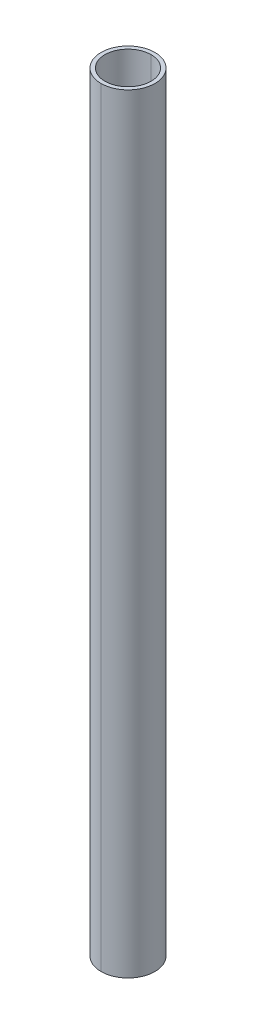
ISO-10303-21;
HEADER;
FILE_DESCRIPTION(('STEP AP214'),'2;1');
FILE_NAME('part.step','',(''),(''),'','','');
FILE_SCHEMA(('AUTOMOTIVE_DESIGN { 1 0 10303 214 1 1 1 1 }'));
ENDSEC;
DATA;
#1=APPLICATION_CONTEXT('core data for automotive mechanical design processes');
#2=APPLICATION_PROTOCOL_DEFINITION('international standard','automotive_design',2000,#1);
#3=PRODUCT_CONTEXT('',#1,'mechanical');
#4=PRODUCT('Part','Part','',(#3));
#5=PRODUCT_RELATED_PRODUCT_CATEGORY('part','',(#4));
#6=PRODUCT_DEFINITION_FORMATION('','',#4);
#7=PRODUCT_DEFINITION_CONTEXT('part definition',#1,'design');
#8=PRODUCT_DEFINITION('design','',#6,#7);
#9=PRODUCT_DEFINITION_SHAPE('','',#8);
#10=(LENGTH_UNIT() NAMED_UNIT(*) SI_UNIT(.MILLI.,.METRE.));
#11=(NAMED_UNIT(*) PLANE_ANGLE_UNIT() SI_UNIT($,.RADIAN.));
#12=(NAMED_UNIT(*) SI_UNIT($,.STERADIAN.) SOLID_ANGLE_UNIT());
#13=UNCERTAINTY_MEASURE_WITH_UNIT(LENGTH_MEASURE(1.E-05),#10,'distance_accuracy_value','');
#14=(GEOMETRIC_REPRESENTATION_CONTEXT(3) GLOBAL_UNCERTAINTY_ASSIGNED_CONTEXT((#13)) GLOBAL_UNIT_ASSIGNED_CONTEXT((#10,
#11,#12)) REPRESENTATION_CONTEXT('',''));
#15=CARTESIAN_POINT('',(0.,0.,0.));
#16=DIRECTION('',(0.,0.,1.));
#17=DIRECTION('',(1.,0.,0.));
#18=AXIS2_PLACEMENT_3D('',#15,#16,#17);
#19=CARTESIAN_POINT('',(0.,200.,0.));
#20=DIRECTION('',(0.,-1.,0.));
#21=DIRECTION('',(0.,0.,-1.));
#22=AXIS2_PLACEMENT_3D('',#19,#20,#21);
#23=CYLINDRICAL_SURFACE('',#22,6.);
#24=CARTESIAN_POINT('',(0.,200.,0.));
#25=DIRECTION('',(0.,1.,0.));
#26=DIRECTION('',(0.,0.,1.));
#27=AXIS2_PLACEMENT_3D('',#24,#25,#26);
#28=CIRCLE('',#27,6.);
#29=CARTESIAN_POINT('',(0.,200.,-6.));
#30=VERTEX_POINT('',#29);
#31=CARTESIAN_POINT('',(0.,200.,6.));
#32=VERTEX_POINT('',#31);
#33=EDGE_CURVE('E11',#30,#32,#28,.T.);
#34=ORIENTED_EDGE('',*,*,#33,.T.);
#35=DIRECTION('',(0.,-1.,0.));
#36=VECTOR('',#35,1.);
#37=CARTESIAN_POINT('',(0.,200.,6.));
#38=LINE('',#37,#36);
#39=CARTESIAN_POINT('',(0.,0.,6.));
#40=VERTEX_POINT('',#39);
#41=EDGE_CURVE('E26',#32,#40,#38,.T.);
#42=ORIENTED_EDGE('',*,*,#41,.T.);
#43=CARTESIAN_POINT('',(0.,0.,0.));
#44=DIRECTION('',(0.,1.,0.));
#45=DIRECTION('',(0.,0.,1.));
#46=AXIS2_PLACEMENT_3D('',#43,#44,#45);
#47=CIRCLE('',#46,6.);
#48=CARTESIAN_POINT('',(0.,0.,-6.));
#49=VERTEX_POINT('',#48);
#50=EDGE_CURVE('E50',#49,#40,#47,.T.);
#51=ORIENTED_EDGE('',*,*,#50,.F.);
#52=DIRECTION('',(0.,-1.,0.));
#53=VECTOR('',#52,1.);
#54=CARTESIAN_POINT('',(0.,200.,-6.));
#55=LINE('',#54,#53);
#56=EDGE_CURVE('E75',#30,#49,#55,.T.);
#57=ORIENTED_EDGE('',*,*,#56,.F.);
#58=EDGE_LOOP('',(#34,#42,#51,#57));
#59=FACE_BOUND('',#58,.T.);
#60=ADVANCED_FACE('F16',(#59),#23,.F.);
#61=CARTESIAN_POINT('',(0.,200.,0.));
#62=DIRECTION('',(0.,-1.,0.));
#63=DIRECTION('',(0.,0.,-1.));
#64=AXIS2_PLACEMENT_3D('',#61,#62,#63);
#65=CYLINDRICAL_SURFACE('',#64,7.);
#66=CARTESIAN_POINT('',(0.,200.,0.));
#67=DIRECTION('',(0.,1.,0.));
#68=DIRECTION('',(0.,0.,1.));
#69=AXIS2_PLACEMENT_3D('',#66,#67,#68);
#70=CIRCLE('',#69,7.);
#71=CARTESIAN_POINT('',(0.,200.,7.));
#72=VERTEX_POINT('',#71);
#73=CARTESIAN_POINT('',(0.,200.,-7.));
#74=VERTEX_POINT('',#73);
#75=EDGE_CURVE('E95',#72,#74,#70,.T.);
#76=ORIENTED_EDGE('',*,*,#75,.F.);
#77=DIRECTION('',(0.,-1.,0.));
#78=VECTOR('',#77,1.);
#79=CARTESIAN_POINT('',(0.,200.,7.));
#80=LINE('',#79,#78);
#81=CARTESIAN_POINT('',(0.,0.,7.));
#82=VERTEX_POINT('',#81);
#83=EDGE_CURVE('E105',#72,#82,#80,.T.);
#84=ORIENTED_EDGE('',*,*,#83,.T.);
#85=CARTESIAN_POINT('',(0.,0.,0.));
#86=DIRECTION('',(0.,1.,0.));
#87=DIRECTION('',(0.,0.,1.));
#88=AXIS2_PLACEMENT_3D('',#85,#86,#87);
#89=CIRCLE('',#88,7.);
#90=CARTESIAN_POINT('',(0.,0.,-7.));
#91=VERTEX_POINT('',#90);
#92=EDGE_CURVE('E20',#82,#91,#89,.T.);
#93=ORIENTED_EDGE('',*,*,#92,.T.);
#94=DIRECTION('',(0.,-1.,0.));
#95=VECTOR('',#94,1.);
#96=CARTESIAN_POINT('',(0.,200.,-7.));
#97=LINE('',#96,#95);
#98=EDGE_CURVE('E91',#74,#91,#97,.T.);
#99=ORIENTED_EDGE('',*,*,#98,.F.);
#100=EDGE_LOOP('',(#76,#84,#93,#99));
#101=FACE_BOUND('',#100,.T.);
#102=ADVANCED_FACE('F126',(#101),#65,.T.);
#103=CARTESIAN_POINT('',(0.,200.,0.));
#104=DIRECTION('',(0.,1.,0.));
#105=DIRECTION('',(1.,0.,0.));
#106=AXIS2_PLACEMENT_3D('',#103,#104,#105);
#107=PLANE('',#106);
#108=CARTESIAN_POINT('',(0.,200.,0.));
#109=DIRECTION('',(0.,1.,0.));
#110=DIRECTION('',(0.,0.,1.));
#111=AXIS2_PLACEMENT_3D('',#108,#109,#110);
#112=CIRCLE('',#111,7.);
#113=EDGE_CURVE('E96',#74,#72,#112,.T.);
#114=ORIENTED_EDGE('',*,*,#113,.T.);
#115=ORIENTED_EDGE('',*,*,#75,.T.);
#116=EDGE_LOOP('',(#114,#115));
#117=FACE_BOUND('',#116,.T.);
#118=ORIENTED_EDGE('',*,*,#33,.F.);
#119=CARTESIAN_POINT('',(0.,200.,0.));
#120=DIRECTION('',(0.,1.,0.));
#121=DIRECTION('',(0.,0.,1.));
#122=AXIS2_PLACEMENT_3D('',#119,#120,#121);
#123=CIRCLE('',#122,6.);
#124=EDGE_CURVE('E79',#32,#30,#123,.T.);
#125=ORIENTED_EDGE('',*,*,#124,.F.);
#126=EDGE_LOOP('',(#118,#125));
#127=FACE_BOUND('',#126,.T.);
#128=ADVANCED_FACE('F81',(#117,#127),#107,.T.);
#129=CARTESIAN_POINT('',(0.,0.,0.));
#130=DIRECTION('',(0.,1.,0.));
#131=DIRECTION('',(1.,0.,0.));
#132=AXIS2_PLACEMENT_3D('',#129,#130,#131);
#133=PLANE('',#132);
#134=CARTESIAN_POINT('',(0.,0.,0.));
#135=DIRECTION('',(0.,1.,0.));
#136=DIRECTION('',(0.,0.,1.));
#137=AXIS2_PLACEMENT_3D('',#134,#135,#136);
#138=CIRCLE('',#137,7.);
#139=EDGE_CURVE('E83',#91,#82,#138,.T.);
#140=ORIENTED_EDGE('',*,*,#139,.F.);
#141=ORIENTED_EDGE('',*,*,#92,.F.);
#142=EDGE_LOOP('',(#140,#141));
#143=FACE_BOUND('',#142,.T.);
#144=ORIENTED_EDGE('',*,*,#50,.T.);
#145=CARTESIAN_POINT('',(0.,0.,0.));
#146=DIRECTION('',(0.,1.,0.));
#147=DIRECTION('',(0.,0.,1.));
#148=AXIS2_PLACEMENT_3D('',#145,#146,#147);
#149=CIRCLE('',#148,6.);
#150=EDGE_CURVE('E101',#40,#49,#149,.T.);
#151=ORIENTED_EDGE('',*,*,#150,.T.);
#152=EDGE_LOOP('',(#144,#151));
#153=FACE_BOUND('',#152,.T.);
#154=ADVANCED_FACE('F128',(#143,#153),#133,.F.);
#155=CARTESIAN_POINT('',(0.,200.,0.));
#156=DIRECTION('',(0.,-1.,0.));
#157=DIRECTION('',(0.,0.,-1.));
#158=AXIS2_PLACEMENT_3D('',#155,#156,#157);
#159=CYLINDRICAL_SURFACE('',#158,7.);
#160=ORIENTED_EDGE('',*,*,#83,.F.);
#161=ORIENTED_EDGE('',*,*,#113,.F.);
#162=ORIENTED_EDGE('',*,*,#98,.T.);
#163=ORIENTED_EDGE('',*,*,#139,.T.);
#164=EDGE_LOOP('',(#160,#161,#162,#163));
#165=FACE_BOUND('',#164,.T.);
#166=ADVANCED_FACE('F123',(#165),#159,.T.);
#167=CARTESIAN_POINT('',(0.,200.,0.));
#168=DIRECTION('',(0.,-1.,0.));
#169=DIRECTION('',(0.,0.,-1.));
#170=AXIS2_PLACEMENT_3D('',#167,#168,#169);
#171=CYLINDRICAL_SURFACE('',#170,6.);
#172=ORIENTED_EDGE('',*,*,#41,.F.);
#173=ORIENTED_EDGE('',*,*,#124,.T.);
#174=ORIENTED_EDGE('',*,*,#56,.T.);
#175=ORIENTED_EDGE('',*,*,#150,.F.);
#176=EDGE_LOOP('',(#172,#173,#174,#175));
#177=FACE_BOUND('',#176,.T.);
#178=ADVANCED_FACE('F18',(#177),#171,.F.);
#179=CLOSED_SHELL('',(#60,#102,#128,#154,#166,#178));
#180=MANIFOLD_SOLID_BREP('B1',#179);
#181=ADVANCED_BREP_SHAPE_REPRESENTATION('',(#18,#180),#14);
#182=SHAPE_DEFINITION_REPRESENTATION(#9,#181);
ENDSEC;
END-ISO-10303-21;
